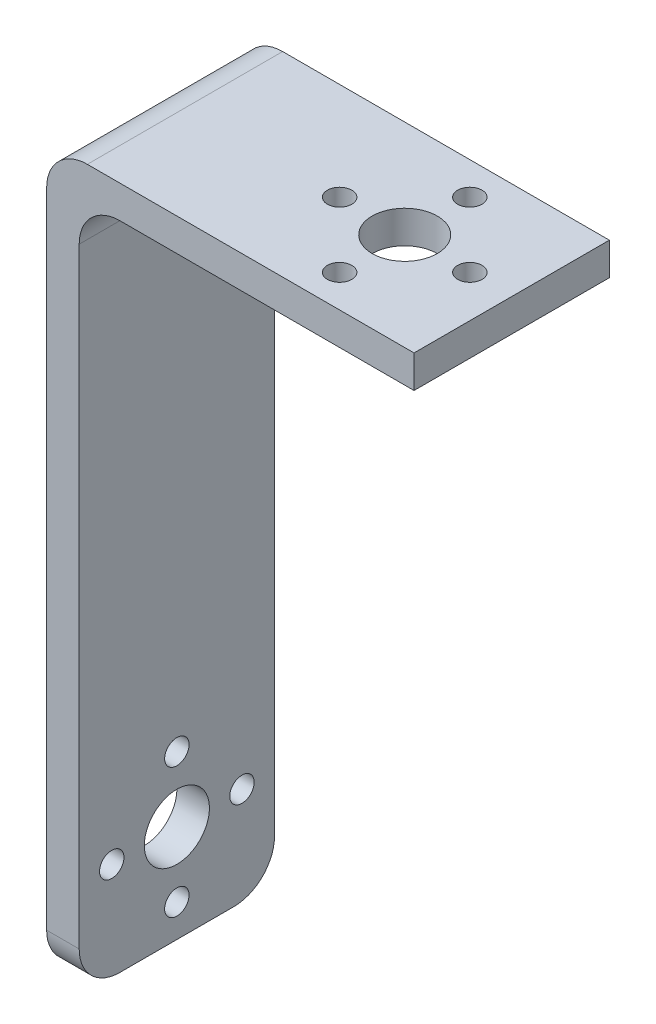
ISO-10303-21;
HEADER;
FILE_DESCRIPTION(('STEP AP214'),'2;1');
FILE_NAME('part.step','',(''),(''),'','','');
FILE_SCHEMA(('AUTOMOTIVE_DESIGN { 1 0 10303 214 1 1 1 1 }'));
ENDSEC;
DATA;
#1=APPLICATION_CONTEXT('core data for automotive mechanical design processes');
#2=APPLICATION_PROTOCOL_DEFINITION('international standard','automotive_design',2000,#1);
#3=PRODUCT_CONTEXT('',#1,'mechanical');
#4=PRODUCT('Part','Part','',(#3));
#5=PRODUCT_RELATED_PRODUCT_CATEGORY('part','',(#4));
#6=PRODUCT_DEFINITION_FORMATION('','',#4);
#7=PRODUCT_DEFINITION_CONTEXT('part definition',#1,'design');
#8=PRODUCT_DEFINITION('design','',#6,#7);
#9=PRODUCT_DEFINITION_SHAPE('','',#8);
#10=(LENGTH_UNIT() NAMED_UNIT(*) SI_UNIT(.MILLI.,.METRE.));
#11=(NAMED_UNIT(*) PLANE_ANGLE_UNIT() SI_UNIT($,.RADIAN.));
#12=(NAMED_UNIT(*) SI_UNIT($,.STERADIAN.) SOLID_ANGLE_UNIT());
#13=UNCERTAINTY_MEASURE_WITH_UNIT(LENGTH_MEASURE(1.E-05),#10,'distance_accuracy_value','');
#14=(GEOMETRIC_REPRESENTATION_CONTEXT(3) GLOBAL_UNCERTAINTY_ASSIGNED_CONTEXT((#13)) GLOBAL_UNIT_ASSIGNED_CONTEXT((#10,
#11,#12)) REPRESENTATION_CONTEXT('',''));
#15=CARTESIAN_POINT('',(0.,0.,0.));
#16=DIRECTION('',(0.,0.,1.));
#17=DIRECTION('',(1.,0.,0.));
#18=AXIS2_PLACEMENT_3D('',#15,#16,#17);
#19=CARTESIAN_POINT('',(0.,46.261961722488,24.));
#20=DIRECTION('',(0.,1.,0.));
#21=DIRECTION('',(0.,0.,1.));
#22=AXIS2_PLACEMENT_3D('',#19,#20,#21);
#23=PLANE('',#22);
#24=CARTESIAN_POINT('',(-7.94771214871035,46.261961722488,12.));
#25=DIRECTION('',(0.,1.,0.));
#26=DIRECTION('',(0.,0.,1.));
#27=AXIS2_PLACEMENT_3D('',#24,#25,#26);
#28=CIRCLE('',#27,4.);
#29=CARTESIAN_POINT('',(-7.94771214871035,46.261961722488,16.));
#30=VERTEX_POINT('',#29);
#31=EDGE_CURVE('E309',#30,#30,#28,.T.);
#32=ORIENTED_EDGE('',*,*,#31,.T.);
#33=EDGE_LOOP('',(#32));
#34=FACE_BOUND('',#33,.T.);
#35=CARTESIAN_POINT('',(-15.9477121487103,46.261961722488,11.9999999999999));
#36=DIRECTION('',(0.,1.,0.));
#37=DIRECTION('',(0.,0.,1.));
#38=AXIS2_PLACEMENT_3D('',#35,#36,#37);
#39=CIRCLE('',#38,1.5);
#40=CARTESIAN_POINT('',(-15.9477121487103,46.261961722488,13.4999999999999));
#41=VERTEX_POINT('',#40);
#42=EDGE_CURVE('E291',#41,#41,#39,.T.);
#43=ORIENTED_EDGE('',*,*,#42,.T.);
#44=EDGE_LOOP('',(#43));
#45=FACE_BOUND('',#44,.T.);
#46=CARTESIAN_POINT('',(-7.94771214871038,46.261961722488,20.));
#47=DIRECTION('',(0.,1.,0.));
#48=DIRECTION('',(0.,0.,1.));
#49=AXIS2_PLACEMENT_3D('',#46,#47,#48);
#50=CIRCLE('',#49,1.5);
#51=CARTESIAN_POINT('',(-7.94771214871038,46.261961722488,21.5));
#52=VERTEX_POINT('',#51);
#53=EDGE_CURVE('E297',#52,#52,#50,.T.);
#54=ORIENTED_EDGE('',*,*,#53,.T.);
#55=EDGE_LOOP('',(#54));
#56=FACE_BOUND('',#55,.T.);
#57=CARTESIAN_POINT('',(0.0522878512896549,46.261961722488,12.));
#58=DIRECTION('',(0.,1.,0.));
#59=DIRECTION('',(0.,0.,1.));
#60=AXIS2_PLACEMENT_3D('',#57,#58,#59);
#61=CIRCLE('',#60,1.5);
#62=CARTESIAN_POINT('',(0.0522878512896549,46.261961722488,13.5));
#63=VERTEX_POINT('',#62);
#64=EDGE_CURVE('E314',#63,#63,#61,.T.);
#65=ORIENTED_EDGE('',*,*,#64,.T.);
#66=EDGE_LOOP('',(#65));
#67=FACE_BOUND('',#66,.T.);
#68=CARTESIAN_POINT('',(-7.94771214871025,46.261961722488,4.));
#69=DIRECTION('',(0.,1.,0.));
#70=DIRECTION('',(0.,0.,1.));
#71=AXIS2_PLACEMENT_3D('',#68,#69,#70);
#72=CIRCLE('',#71,1.5);
#73=CARTESIAN_POINT('',(-7.94771214871025,46.261961722488,5.5));
#74=VERTEX_POINT('',#73);
#75=EDGE_CURVE('E324',#74,#74,#72,.T.);
#76=ORIENTED_EDGE('',*,*,#75,.T.);
#77=EDGE_LOOP('',(#76));
#78=FACE_BOUND('',#77,.T.);
#79=DIRECTION('',(1.,0.,0.));
#80=VECTOR('',#79,1.);
#81=CARTESIAN_POINT('',(0.,46.261961722488,24.));
#82=LINE('',#81,#80);
#83=CARTESIAN_POINT('',(-30.9477121487103,46.261961722488,24.));
#84=VERTEX_POINT('',#83);
#85=CARTESIAN_POINT('',(5.19705030250339,46.261961722488,24.));
#86=VERTEX_POINT('',#85);
#87=EDGE_CURVE('E117',#84,#86,#82,.T.);
#88=ORIENTED_EDGE('',*,*,#87,.F.);
#89=DIRECTION('',(0.,0.,-1.));
#90=VECTOR('',#89,1.);
#91=CARTESIAN_POINT('',(-30.9477121487103,46.261961722488,0.));
#92=LINE('',#91,#90);
#93=CARTESIAN_POINT('',(-30.9477121487103,46.261961722488,0.));
#94=VERTEX_POINT('',#93);
#95=EDGE_CURVE('E145',#84,#94,#92,.T.);
#96=ORIENTED_EDGE('',*,*,#95,.T.);
#97=DIRECTION('',(1.,0.,0.));
#98=VECTOR('',#97,1.);
#99=CARTESIAN_POINT('',(0.,46.261961722488,0.));
#100=LINE('',#99,#98);
#101=CARTESIAN_POINT('',(5.19705030250339,46.261961722488,0.));
#102=VERTEX_POINT('',#101);
#103=EDGE_CURVE('E142',#94,#102,#100,.T.);
#104=ORIENTED_EDGE('',*,*,#103,.T.);
#105=DIRECTION('',(0.,0.,-1.));
#106=VECTOR('',#105,1.);
#107=CARTESIAN_POINT('',(5.19705030250339,46.261961722488,24.));
#108=LINE('',#107,#106);
#109=EDGE_CURVE('E135',#86,#102,#108,.T.);
#110=ORIENTED_EDGE('',*,*,#109,.F.);
#111=EDGE_LOOP('',(#88,#96,#104,#110));
#112=FACE_BOUND('',#111,.T.);
#113=ADVANCED_FACE('F40',(#34,#45,#56,#67,#78,#112),#23,.F.);
#114=CARTESIAN_POINT('',(5.19705030250339,0.,24.));
#115=DIRECTION('',(-1.,0.,0.));
#116=DIRECTION('',(0.,0.,1.));
#117=AXIS2_PLACEMENT_3D('',#114,#115,#116);
#118=PLANE('',#117);
#119=DIRECTION('',(0.,1.,0.));
#120=VECTOR('',#119,1.);
#121=CARTESIAN_POINT('',(5.19705030250339,0.,0.));
#122=LINE('',#121,#120);
#123=CARTESIAN_POINT('',(5.19705030250339,50.2619617224881,0.));
#124=VERTEX_POINT('',#123);
#125=EDGE_CURVE('E382',#102,#124,#122,.T.);
#126=ORIENTED_EDGE('',*,*,#125,.T.);
#127=DIRECTION('',(0.,0.,-1.));
#128=VECTOR('',#127,1.);
#129=CARTESIAN_POINT('',(5.19705030250339,50.2619617224881,24.));
#130=LINE('',#129,#128);
#131=CARTESIAN_POINT('',(5.19705030250339,50.2619617224881,24.));
#132=VERTEX_POINT('',#131);
#133=EDGE_CURVE('E137',#132,#124,#130,.T.);
#134=ORIENTED_EDGE('',*,*,#133,.F.);
#135=DIRECTION('',(0.,1.,0.));
#136=VECTOR('',#135,1.);
#137=CARTESIAN_POINT('',(5.19705030250339,0.,24.));
#138=LINE('',#137,#136);
#139=EDGE_CURVE('E120',#86,#132,#138,.T.);
#140=ORIENTED_EDGE('',*,*,#139,.F.);
#141=ORIENTED_EDGE('',*,*,#109,.T.);
#142=EDGE_LOOP('',(#126,#134,#140,#141));
#143=FACE_BOUND('',#142,.T.);
#144=ADVANCED_FACE('F134',(#143),#118,.F.);
#145=CARTESIAN_POINT('',(0.,50.2619617224881,24.));
#146=DIRECTION('',(0.,1.,0.));
#147=DIRECTION('',(0.,0.,1.));
#148=AXIS2_PLACEMENT_3D('',#145,#146,#147);
#149=PLANE('',#148);
#150=CARTESIAN_POINT('',(-7.94771214871035,50.2619617224881,12.));
#151=DIRECTION('',(0.,1.,0.));
#152=DIRECTION('',(0.,0.,1.));
#153=AXIS2_PLACEMENT_3D('',#150,#151,#152);
#154=CIRCLE('',#153,4.);
#155=CARTESIAN_POINT('',(-7.94771214871035,50.2619617224881,16.));
#156=VERTEX_POINT('',#155);
#157=EDGE_CURVE('E306',#156,#156,#154,.T.);
#158=ORIENTED_EDGE('',*,*,#157,.F.);
#159=EDGE_LOOP('',(#158));
#160=FACE_BOUND('',#159,.T.);
#161=CARTESIAN_POINT('',(-15.9477121487103,50.2619617224881,11.9999999999999));
#162=DIRECTION('',(0.,1.,0.));
#163=DIRECTION('',(0.,0.,1.));
#164=AXIS2_PLACEMENT_3D('',#161,#162,#163);
#165=CIRCLE('',#164,1.5);
#166=CARTESIAN_POINT('',(-15.9477121487103,50.2619617224881,13.4999999999999));
#167=VERTEX_POINT('',#166);
#168=EDGE_CURVE('E294',#167,#167,#165,.T.);
#169=ORIENTED_EDGE('',*,*,#168,.F.);
#170=EDGE_LOOP('',(#169));
#171=FACE_BOUND('',#170,.T.);
#172=CARTESIAN_POINT('',(-7.94771214871038,50.2619617224881,20.));
#173=DIRECTION('',(0.,1.,0.));
#174=DIRECTION('',(0.,0.,1.));
#175=AXIS2_PLACEMENT_3D('',#172,#173,#174);
#176=CIRCLE('',#175,1.5);
#177=CARTESIAN_POINT('',(-7.94771214871038,50.2619617224881,21.5));
#178=VERTEX_POINT('',#177);
#179=EDGE_CURVE('E303',#178,#178,#176,.T.);
#180=ORIENTED_EDGE('',*,*,#179,.F.);
#181=EDGE_LOOP('',(#180));
#182=FACE_BOUND('',#181,.T.);
#183=CARTESIAN_POINT('',(0.0522878512896549,50.2619617224881,12.));
#184=DIRECTION('',(0.,1.,0.));
#185=DIRECTION('',(0.,0.,1.));
#186=AXIS2_PLACEMENT_3D('',#183,#184,#185);
#187=CIRCLE('',#186,1.5);
#188=CARTESIAN_POINT('',(0.0522878512896549,50.2619617224881,13.5));
#189=VERTEX_POINT('',#188);
#190=EDGE_CURVE('E316',#189,#189,#187,.T.);
#191=ORIENTED_EDGE('',*,*,#190,.F.);
#192=EDGE_LOOP('',(#191));
#193=FACE_BOUND('',#192,.T.);
#194=CARTESIAN_POINT('',(-7.94771214871025,50.2619617224881,4.));
#195=DIRECTION('',(0.,1.,0.));
#196=DIRECTION('',(0.,0.,1.));
#197=AXIS2_PLACEMENT_3D('',#194,#195,#196);
#198=CIRCLE('',#197,1.5);
#199=CARTESIAN_POINT('',(-7.94771214871025,50.2619617224881,5.5));
#200=VERTEX_POINT('',#199);
#201=EDGE_CURVE('E320',#200,#200,#198,.T.);
#202=ORIENTED_EDGE('',*,*,#201,.F.);
#203=EDGE_LOOP('',(#202));
#204=FACE_BOUND('',#203,.T.);
#205=DIRECTION('',(1.,0.,0.));
#206=VECTOR('',#205,1.);
#207=CARTESIAN_POINT('',(0.,50.2619617224881,0.));
#208=LINE('',#207,#206);
#209=CARTESIAN_POINT('',(-34.9477121487104,50.2619617224881,0.));
#210=VERTEX_POINT('',#209);
#211=EDGE_CURVE('E384',#210,#124,#208,.T.);
#212=ORIENTED_EDGE('',*,*,#211,.F.);
#213=DIRECTION('',(0.,0.,-1.));
#214=VECTOR('',#213,1.);
#215=CARTESIAN_POINT('',(-34.9477121487104,50.2619617224881,24.));
#216=LINE('',#215,#214);
#217=CARTESIAN_POINT('',(-34.9477121487104,50.2619617224881,24.));
#218=VERTEX_POINT('',#217);
#219=EDGE_CURVE('E56',#210,#218,#216,.F.);
#220=ORIENTED_EDGE('',*,*,#219,.T.);
#221=DIRECTION('',(1.,0.,0.));
#222=VECTOR('',#221,1.);
#223=CARTESIAN_POINT('',(0.,50.2619617224881,24.));
#224=LINE('',#223,#222);
#225=EDGE_CURVE('E139',#218,#132,#224,.T.);
#226=ORIENTED_EDGE('',*,*,#225,.T.);
#227=ORIENTED_EDGE('',*,*,#133,.T.);
#228=EDGE_LOOP('',(#212,#220,#226,#227));
#229=FACE_BOUND('',#228,.T.);
#230=ADVANCED_FACE('F229',(#160,#171,#182,#193,#204,#229),#149,.T.);
#231=CARTESIAN_POINT('',(-39.9477121487103,0.,24.));
#232=DIRECTION('',(-1.,0.,0.));
#233=DIRECTION('',(0.,0.,1.));
#234=AXIS2_PLACEMENT_3D('',#231,#232,#233);
#235=PLANE('',#234);
#236=CARTESIAN_POINT('',(-39.9477121487103,-26.7380382775119,4.));
#237=DIRECTION('',(-1.,0.,0.));
#238=DIRECTION('',(0.,0.,1.));
#239=AXIS2_PLACEMENT_3D('',#236,#237,#238);
#240=CIRCLE('',#239,1.5);
#241=CARTESIAN_POINT('',(-39.9477121487103,-26.7380382775119,5.5));
#242=VERTEX_POINT('',#241);
#243=EDGE_CURVE('E332',#242,#242,#240,.T.);
#244=ORIENTED_EDGE('',*,*,#243,.F.);
#245=EDGE_LOOP('',(#244));
#246=FACE_BOUND('',#245,.T.);
#247=CARTESIAN_POINT('',(-39.9477121487103,-34.738038277512,12.));
#248=DIRECTION('',(-1.,0.,0.));
#249=DIRECTION('',(0.,0.,1.));
#250=AXIS2_PLACEMENT_3D('',#247,#248,#249);
#251=CIRCLE('',#250,1.5);
#252=CARTESIAN_POINT('',(-39.9477121487103,-34.738038277512,13.5));
#253=VERTEX_POINT('',#252);
#254=EDGE_CURVE('E340',#253,#253,#251,.T.);
#255=ORIENTED_EDGE('',*,*,#254,.F.);
#256=EDGE_LOOP('',(#255));
#257=FACE_BOUND('',#256,.T.);
#258=CARTESIAN_POINT('',(-39.9477121487103,-26.738038277512,12.));
#259=DIRECTION('',(-1.,0.,0.));
#260=DIRECTION('',(0.,0.,1.));
#261=AXIS2_PLACEMENT_3D('',#258,#259,#260);
#262=CIRCLE('',#261,4.);
#263=CARTESIAN_POINT('',(-39.9477121487103,-26.738038277512,16.));
#264=VERTEX_POINT('',#263);
#265=EDGE_CURVE('E348',#264,#264,#262,.T.);
#266=ORIENTED_EDGE('',*,*,#265,.F.);
#267=EDGE_LOOP('',(#266));
#268=FACE_BOUND('',#267,.T.);
#269=CARTESIAN_POINT('',(-39.9477121487103,-26.738038277512,20.));
#270=DIRECTION('',(-1.,0.,0.));
#271=DIRECTION('',(0.,0.,1.));
#272=AXIS2_PLACEMENT_3D('',#269,#270,#271);
#273=CIRCLE('',#272,1.5);
#274=CARTESIAN_POINT('',(-39.9477121487103,-26.738038277512,21.5));
#275=VERTEX_POINT('',#274);
#276=EDGE_CURVE('E355',#275,#275,#273,.T.);
#277=ORIENTED_EDGE('',*,*,#276,.F.);
#278=EDGE_LOOP('',(#277));
#279=FACE_BOUND('',#278,.T.);
#280=CARTESIAN_POINT('',(-39.9477121487103,-18.738038277512,12.0000000000001));
#281=DIRECTION('',(-1.,0.,0.));
#282=DIRECTION('',(0.,0.,1.));
#283=AXIS2_PLACEMENT_3D('',#280,#281,#282);
#284=CIRCLE('',#283,1.5);
#285=CARTESIAN_POINT('',(-39.9477121487103,-18.738038277512,13.5000000000001));
#286=VERTEX_POINT('',#285);
#287=EDGE_CURVE('E359',#286,#286,#284,.T.);
#288=ORIENTED_EDGE('',*,*,#287,.F.);
#289=EDGE_LOOP('',(#288));
#290=FACE_BOUND('',#289,.T.);
#291=DIRECTION('',(0.,1.,0.));
#292=VECTOR('',#291,1.);
#293=CARTESIAN_POINT('',(-39.9477121487103,0.,24.));
#294=LINE('',#293,#292);
#295=CARTESIAN_POINT('',(-39.9477121487103,-33.738038277512,24.));
#296=VERTEX_POINT('',#295);
#297=CARTESIAN_POINT('',(-39.9477121487103,45.2619617224881,24.));
#298=VERTEX_POINT('',#297);
#299=EDGE_CURVE('E372',#296,#298,#294,.T.);
#300=ORIENTED_EDGE('',*,*,#299,.T.);
#301=DIRECTION('',(0.,0.,-1.));
#302=VECTOR('',#301,1.);
#303=CARTESIAN_POINT('',(-39.9477121487103,45.2619617224881,24.));
#304=LINE('',#303,#302);
#305=CARTESIAN_POINT('',(-39.9477121487103,45.2619617224881,0.));
#306=VERTEX_POINT('',#305);
#307=EDGE_CURVE('E170',#298,#306,#304,.T.);
#308=ORIENTED_EDGE('',*,*,#307,.T.);
#309=DIRECTION('',(0.,1.,0.));
#310=VECTOR('',#309,1.);
#311=CARTESIAN_POINT('',(-39.9477121487103,0.,0.));
#312=LINE('',#311,#310);
#313=CARTESIAN_POINT('',(-39.9477121487103,-33.738038277512,0.));
#314=VERTEX_POINT('',#313);
#315=EDGE_CURVE('E206',#314,#306,#312,.T.);
#316=ORIENTED_EDGE('',*,*,#315,.F.);
#317=CARTESIAN_POINT('',(-39.9477121487103,-33.738038277512,5.));
#318=DIRECTION('',(-1.,0.,0.));
#319=DIRECTION('',(0.,0.,1.));
#320=AXIS2_PLACEMENT_3D('',#317,#318,#319);
#321=CIRCLE('',#320,5.);
#322=CARTESIAN_POINT('',(-39.9477121487103,-38.738038277512,5.));
#323=VERTEX_POINT('',#322);
#324=EDGE_CURVE('E167',#314,#323,#321,.T.);
#325=ORIENTED_EDGE('',*,*,#324,.T.);
#326=DIRECTION('',(0.,0.,-1.));
#327=VECTOR('',#326,1.);
#328=CARTESIAN_POINT('',(-39.9477121487103,-38.738038277512,24.));
#329=LINE('',#328,#327);
#330=CARTESIAN_POINT('',(-39.9477121487103,-38.738038277512,19.));
#331=VERTEX_POINT('',#330);
#332=EDGE_CURVE('E152',#331,#323,#329,.T.);
#333=ORIENTED_EDGE('',*,*,#332,.F.);
#334=CARTESIAN_POINT('',(-39.9477121487103,-33.738038277512,19.));
#335=DIRECTION('',(-1.,0.,0.));
#336=DIRECTION('',(0.,0.,1.));
#337=AXIS2_PLACEMENT_3D('',#334,#335,#336);
#338=CIRCLE('',#337,5.);
#339=EDGE_CURVE('E164',#331,#296,#338,.T.);
#340=ORIENTED_EDGE('',*,*,#339,.T.);
#341=EDGE_LOOP('',(#300,#308,#316,#325,#333,#340));
#342=FACE_BOUND('',#341,.T.);
#343=ADVANCED_FACE('F236',(#246,#257,#268,#279,#290,#342),#235,.T.);
#344=CARTESIAN_POINT('',(0.,-38.738038277512,24.));
#345=DIRECTION('',(0.,1.,0.));
#346=DIRECTION('',(0.,0.,1.));
#347=AXIS2_PLACEMENT_3D('',#344,#345,#346);
#348=PLANE('',#347);
#349=ORIENTED_EDGE('',*,*,#332,.T.);
#350=DIRECTION('',(1.,0.,0.));
#351=VECTOR('',#350,1.);
#352=CARTESIAN_POINT('',(0.,-38.738038277512,5.));
#353=LINE('',#352,#351);
#354=CARTESIAN_POINT('',(-35.9477121487103,-38.738038277512,5.));
#355=VERTEX_POINT('',#354);
#356=EDGE_CURVE('E191',#323,#355,#353,.T.);
#357=ORIENTED_EDGE('',*,*,#356,.T.);
#358=DIRECTION('',(0.,0.,-1.));
#359=VECTOR('',#358,1.);
#360=CARTESIAN_POINT('',(-35.9477121487103,-38.738038277512,24.));
#361=LINE('',#360,#359);
#362=CARTESIAN_POINT('',(-35.9477121487103,-38.738038277512,19.));
#363=VERTEX_POINT('',#362);
#364=EDGE_CURVE('E379',#363,#355,#361,.T.);
#365=ORIENTED_EDGE('',*,*,#364,.F.);
#366=DIRECTION('',(1.,0.,0.));
#367=VECTOR('',#366,1.);
#368=CARTESIAN_POINT('',(-39.9477121487103,-38.738038277512,19.));
#369=LINE('',#368,#367);
#370=EDGE_CURVE('E188',#363,#331,#369,.F.);
#371=ORIENTED_EDGE('',*,*,#370,.T.);
#372=EDGE_LOOP('',(#349,#357,#365,#371));
#373=FACE_BOUND('',#372,.T.);
#374=ADVANCED_FACE('F240',(#373),#348,.F.);
#375=CARTESIAN_POINT('',(-35.9477121487103,0.,24.));
#376=DIRECTION('',(-1.,0.,0.));
#377=DIRECTION('',(0.,0.,1.));
#378=AXIS2_PLACEMENT_3D('',#375,#376,#377);
#379=PLANE('',#378);
#380=CARTESIAN_POINT('',(-35.9477121487103,-26.7380382775119,4.));
#381=DIRECTION('',(-1.,0.,0.));
#382=DIRECTION('',(0.,0.,1.));
#383=AXIS2_PLACEMENT_3D('',#380,#381,#382);
#384=CIRCLE('',#383,1.5);
#385=CARTESIAN_POINT('',(-35.9477121487103,-26.7380382775119,5.5));
#386=VERTEX_POINT('',#385);
#387=EDGE_CURVE('E328',#386,#386,#384,.T.);
#388=ORIENTED_EDGE('',*,*,#387,.T.);
#389=EDGE_LOOP('',(#388));
#390=FACE_BOUND('',#389,.T.);
#391=CARTESIAN_POINT('',(-35.9477121487103,-34.738038277512,12.));
#392=DIRECTION('',(-1.,0.,0.));
#393=DIRECTION('',(0.,0.,1.));
#394=AXIS2_PLACEMENT_3D('',#391,#392,#393);
#395=CIRCLE('',#394,1.5);
#396=CARTESIAN_POINT('',(-35.9477121487103,-34.738038277512,13.5));
#397=VERTEX_POINT('',#396);
#398=EDGE_CURVE('E336',#397,#397,#395,.T.);
#399=ORIENTED_EDGE('',*,*,#398,.T.);
#400=EDGE_LOOP('',(#399));
#401=FACE_BOUND('',#400,.T.);
#402=CARTESIAN_POINT('',(-35.9477121487103,-26.738038277512,12.));
#403=DIRECTION('',(-1.,0.,0.));
#404=DIRECTION('',(0.,0.,1.));
#405=AXIS2_PLACEMENT_3D('',#402,#403,#404);
#406=CIRCLE('',#405,4.);
#407=CARTESIAN_POINT('',(-35.9477121487103,-26.738038277512,16.));
#408=VERTEX_POINT('',#407);
#409=EDGE_CURVE('E344',#408,#408,#406,.T.);
#410=ORIENTED_EDGE('',*,*,#409,.T.);
#411=EDGE_LOOP('',(#410));
#412=FACE_BOUND('',#411,.T.);
#413=CARTESIAN_POINT('',(-35.9477121487103,-26.738038277512,20.));
#414=DIRECTION('',(-1.,0.,0.));
#415=DIRECTION('',(0.,0.,1.));
#416=AXIS2_PLACEMENT_3D('',#413,#414,#415);
#417=CIRCLE('',#416,1.5);
#418=CARTESIAN_POINT('',(-35.9477121487103,-26.738038277512,21.5));
#419=VERTEX_POINT('',#418);
#420=EDGE_CURVE('E351',#419,#419,#417,.T.);
#421=ORIENTED_EDGE('',*,*,#420,.T.);
#422=EDGE_LOOP('',(#421));
#423=FACE_BOUND('',#422,.T.);
#424=CARTESIAN_POINT('',(-35.9477121487103,-18.738038277512,12.0000000000001));
#425=DIRECTION('',(-1.,0.,0.));
#426=DIRECTION('',(0.,0.,1.));
#427=AXIS2_PLACEMENT_3D('',#424,#425,#426);
#428=CIRCLE('',#427,1.5);
#429=CARTESIAN_POINT('',(-35.9477121487103,-18.738038277512,13.5000000000001));
#430=VERTEX_POINT('',#429);
#431=EDGE_CURVE('E363',#430,#430,#428,.T.);
#432=ORIENTED_EDGE('',*,*,#431,.T.);
#433=EDGE_LOOP('',(#432));
#434=FACE_BOUND('',#433,.T.);
#435=DIRECTION('',(0.,1.,0.));
#436=VECTOR('',#435,1.);
#437=CARTESIAN_POINT('',(-35.9477121487103,0.,0.));
#438=LINE('',#437,#436);
#439=CARTESIAN_POINT('',(-35.9477121487103,-33.738038277512,0.));
#440=VERTEX_POINT('',#439);
#441=CARTESIAN_POINT('',(-35.9477121487103,41.261961722488,0.));
#442=VERTEX_POINT('',#441);
#443=EDGE_CURVE('E129',#440,#442,#438,.T.);
#444=ORIENTED_EDGE('',*,*,#443,.T.);
#445=DIRECTION('',(0.,0.,-1.));
#446=VECTOR('',#445,1.);
#447=CARTESIAN_POINT('',(-35.9477121487103,41.261961722488,24.));
#448=LINE('',#447,#446);
#449=CARTESIAN_POINT('',(-35.9477121487103,41.261961722488,24.));
#450=VERTEX_POINT('',#449);
#451=EDGE_CURVE('E161',#442,#450,#448,.F.);
#452=ORIENTED_EDGE('',*,*,#451,.T.);
#453=DIRECTION('',(0.,1.,0.));
#454=VECTOR('',#453,1.);
#455=CARTESIAN_POINT('',(-35.9477121487103,0.,24.));
#456=LINE('',#455,#454);
#457=CARTESIAN_POINT('',(-35.9477121487103,-33.738038277512,24.));
#458=VERTEX_POINT('',#457);
#459=EDGE_CURVE('E376',#458,#450,#456,.T.);
#460=ORIENTED_EDGE('',*,*,#459,.F.);
#461=CARTESIAN_POINT('',(-35.9477121487103,-33.738038277512,19.));
#462=DIRECTION('',(-1.,0.,0.));
#463=DIRECTION('',(0.,0.,1.));
#464=AXIS2_PLACEMENT_3D('',#461,#462,#463);
#465=CIRCLE('',#464,5.);
#466=EDGE_CURVE('E149',#458,#363,#465,.F.);
#467=ORIENTED_EDGE('',*,*,#466,.T.);
#468=ORIENTED_EDGE('',*,*,#364,.T.);
#469=CARTESIAN_POINT('',(-35.9477121487103,-33.738038277512,5.));
#470=DIRECTION('',(-1.,0.,0.));
#471=DIRECTION('',(0.,0.,1.));
#472=AXIS2_PLACEMENT_3D('',#469,#470,#471);
#473=CIRCLE('',#472,5.);
#474=EDGE_CURVE('E158',#355,#440,#473,.F.);
#475=ORIENTED_EDGE('',*,*,#474,.T.);
#476=EDGE_LOOP('',(#444,#452,#460,#467,#468,#475));
#477=FACE_BOUND('',#476,.T.);
#478=ADVANCED_FACE('F202',(#390,#401,#412,#423,#434,#477),#379,.F.);
#479=CARTESIAN_POINT('',(0.,0.,24.));
#480=DIRECTION('',(0.,0.,1.));
#481=DIRECTION('',(1.,0.,0.));
#482=AXIS2_PLACEMENT_3D('',#479,#480,#481);
#483=PLANE('',#482);
#484=ORIENTED_EDGE('',*,*,#225,.F.);
#485=CARTESIAN_POINT('',(-34.9477121487104,45.2619617224881,24.));
#486=DIRECTION('',(0.,0.,1.));
#487=DIRECTION('',(1.,0.,0.));
#488=AXIS2_PLACEMENT_3D('',#485,#486,#487);
#489=CIRCLE('',#488,5.);
#490=EDGE_CURVE('E185',#218,#298,#489,.T.);
#491=ORIENTED_EDGE('',*,*,#490,.T.);
#492=ORIENTED_EDGE('',*,*,#299,.F.);
#493=DIRECTION('',(1.,0.,0.));
#494=VECTOR('',#493,1.);
#495=CARTESIAN_POINT('',(-35.9477121487103,-33.738038277512,24.));
#496=LINE('',#495,#494);
#497=EDGE_CURVE('E181',#296,#458,#496,.T.);
#498=ORIENTED_EDGE('',*,*,#497,.T.);
#499=ORIENTED_EDGE('',*,*,#459,.T.);
#500=CARTESIAN_POINT('',(-30.9477121487103,41.261961722488,24.));
#501=DIRECTION('',(0.,0.,1.));
#502=DIRECTION('',(1.,0.,0.));
#503=AXIS2_PLACEMENT_3D('',#500,#501,#502);
#504=CIRCLE('',#503,5.);
#505=EDGE_CURVE('E11',#450,#84,#504,.F.);
#506=ORIENTED_EDGE('',*,*,#505,.T.);
#507=ORIENTED_EDGE('',*,*,#87,.T.);
#508=ORIENTED_EDGE('',*,*,#139,.T.);
#509=EDGE_LOOP('',(#484,#491,#492,#498,#499,#506,#507,#508));
#510=FACE_BOUND('',#509,.T.);
#511=ADVANCED_FACE('F119',(#510),#483,.T.);
#512=CARTESIAN_POINT('',(0.,0.,0.));
#513=DIRECTION('',(0.,0.,1.));
#514=DIRECTION('',(1.,0.,0.));
#515=AXIS2_PLACEMENT_3D('',#512,#513,#514);
#516=PLANE('',#515);
#517=ORIENTED_EDGE('',*,*,#315,.T.);
#518=CARTESIAN_POINT('',(-34.9477121487104,45.2619617224881,0.));
#519=DIRECTION('',(0.,0.,1.));
#520=DIRECTION('',(1.,0.,0.));
#521=AXIS2_PLACEMENT_3D('',#518,#519,#520);
#522=CIRCLE('',#521,5.);
#523=EDGE_CURVE('E64',#306,#210,#522,.F.);
#524=ORIENTED_EDGE('',*,*,#523,.T.);
#525=ORIENTED_EDGE('',*,*,#211,.T.);
#526=ORIENTED_EDGE('',*,*,#125,.F.);
#527=ORIENTED_EDGE('',*,*,#103,.F.);
#528=CARTESIAN_POINT('',(-30.9477121487103,41.261961722488,0.));
#529=DIRECTION('',(0.,0.,1.));
#530=DIRECTION('',(1.,0.,0.));
#531=AXIS2_PLACEMENT_3D('',#528,#529,#530);
#532=CIRCLE('',#531,5.);
#533=EDGE_CURVE('E49',#94,#442,#532,.T.);
#534=ORIENTED_EDGE('',*,*,#533,.T.);
#535=ORIENTED_EDGE('',*,*,#443,.F.);
#536=DIRECTION('',(1.,0.,0.));
#537=VECTOR('',#536,1.);
#538=CARTESIAN_POINT('',(0.,-33.738038277512,0.));
#539=LINE('',#538,#537);
#540=EDGE_CURVE('E174',#440,#314,#539,.F.);
#541=ORIENTED_EDGE('',*,*,#540,.T.);
#542=EDGE_LOOP('',(#517,#524,#525,#526,#527,#534,#535,#541));
#543=FACE_BOUND('',#542,.T.);
#544=ADVANCED_FACE('F197',(#543),#516,.F.);
#545=CARTESIAN_POINT('',(-35.9477121487103,-18.738038277512,12.0000000000001));
#546=DIRECTION('',(-1.,0.,0.));
#547=DIRECTION('',(0.,0.,1.));
#548=AXIS2_PLACEMENT_3D('',#545,#546,#547);
#549=CYLINDRICAL_SURFACE('',#548,1.5);
#550=ORIENTED_EDGE('',*,*,#431,.F.);
#551=EDGE_LOOP('',(#550));
#552=FACE_BOUND('',#551,.T.);
#553=ORIENTED_EDGE('',*,*,#287,.T.);
#554=EDGE_LOOP('',(#553));
#555=FACE_BOUND('',#554,.T.);
#556=ADVANCED_FACE('F250',(#552,#555),#549,.F.);
#557=CARTESIAN_POINT('',(-35.9477121487103,-26.738038277512,20.));
#558=DIRECTION('',(-1.,0.,0.));
#559=DIRECTION('',(0.,0.,1.));
#560=AXIS2_PLACEMENT_3D('',#557,#558,#559);
#561=CYLINDRICAL_SURFACE('',#560,1.5);
#562=ORIENTED_EDGE('',*,*,#420,.F.);
#563=EDGE_LOOP('',(#562));
#564=FACE_BOUND('',#563,.T.);
#565=ORIENTED_EDGE('',*,*,#276,.T.);
#566=EDGE_LOOP('',(#565));
#567=FACE_BOUND('',#566,.T.);
#568=ADVANCED_FACE('F255',(#564,#567),#561,.F.);
#569=CARTESIAN_POINT('',(-35.9477121487103,-26.738038277512,12.));
#570=DIRECTION('',(-1.,0.,0.));
#571=DIRECTION('',(0.,0.,1.));
#572=AXIS2_PLACEMENT_3D('',#569,#570,#571);
#573=CYLINDRICAL_SURFACE('',#572,4.);
#574=ORIENTED_EDGE('',*,*,#409,.F.);
#575=EDGE_LOOP('',(#574));
#576=FACE_BOUND('',#575,.T.);
#577=ORIENTED_EDGE('',*,*,#265,.T.);
#578=EDGE_LOOP('',(#577));
#579=FACE_BOUND('',#578,.T.);
#580=ADVANCED_FACE('F259',(#576,#579),#573,.F.);
#581=CARTESIAN_POINT('',(-35.9477121487103,-34.738038277512,12.));
#582=DIRECTION('',(-1.,0.,0.));
#583=DIRECTION('',(0.,0.,1.));
#584=AXIS2_PLACEMENT_3D('',#581,#582,#583);
#585=CYLINDRICAL_SURFACE('',#584,1.5);
#586=ORIENTED_EDGE('',*,*,#398,.F.);
#587=EDGE_LOOP('',(#586));
#588=FACE_BOUND('',#587,.T.);
#589=ORIENTED_EDGE('',*,*,#254,.T.);
#590=EDGE_LOOP('',(#589));
#591=FACE_BOUND('',#590,.T.);
#592=ADVANCED_FACE('F263',(#588,#591),#585,.F.);
#593=CARTESIAN_POINT('',(-35.9477121487103,-26.7380382775119,4.));
#594=DIRECTION('',(-1.,0.,0.));
#595=DIRECTION('',(0.,0.,1.));
#596=AXIS2_PLACEMENT_3D('',#593,#594,#595);
#597=CYLINDRICAL_SURFACE('',#596,1.5);
#598=ORIENTED_EDGE('',*,*,#387,.F.);
#599=EDGE_LOOP('',(#598));
#600=FACE_BOUND('',#599,.T.);
#601=ORIENTED_EDGE('',*,*,#243,.T.);
#602=EDGE_LOOP('',(#601));
#603=FACE_BOUND('',#602,.T.);
#604=ADVANCED_FACE('F267',(#600,#603),#597,.F.);
#605=CARTESIAN_POINT('',(-7.94771214871025,46.261961722488,4.));
#606=DIRECTION('',(0.,1.,0.));
#607=DIRECTION('',(0.,0.,1.));
#608=AXIS2_PLACEMENT_3D('',#605,#606,#607);
#609=CYLINDRICAL_SURFACE('',#608,1.5);
#610=ORIENTED_EDGE('',*,*,#75,.F.);
#611=EDGE_LOOP('',(#610));
#612=FACE_BOUND('',#611,.T.);
#613=ORIENTED_EDGE('',*,*,#201,.T.);
#614=EDGE_LOOP('',(#613));
#615=FACE_BOUND('',#614,.T.);
#616=ADVANCED_FACE('F271',(#612,#615),#609,.F.);
#617=CARTESIAN_POINT('',(0.0522878512896549,46.261961722488,12.));
#618=DIRECTION('',(0.,1.,0.));
#619=DIRECTION('',(0.,0.,1.));
#620=AXIS2_PLACEMENT_3D('',#617,#618,#619);
#621=CYLINDRICAL_SURFACE('',#620,1.5);
#622=ORIENTED_EDGE('',*,*,#64,.F.);
#623=EDGE_LOOP('',(#622));
#624=FACE_BOUND('',#623,.T.);
#625=ORIENTED_EDGE('',*,*,#190,.T.);
#626=EDGE_LOOP('',(#625));
#627=FACE_BOUND('',#626,.T.);
#628=ADVANCED_FACE('F275',(#624,#627),#621,.F.);
#629=CARTESIAN_POINT('',(-7.94771214871038,46.261961722488,20.));
#630=DIRECTION('',(0.,1.,0.));
#631=DIRECTION('',(0.,0.,1.));
#632=AXIS2_PLACEMENT_3D('',#629,#630,#631);
#633=CYLINDRICAL_SURFACE('',#632,1.5);
#634=ORIENTED_EDGE('',*,*,#53,.F.);
#635=EDGE_LOOP('',(#634));
#636=FACE_BOUND('',#635,.T.);
#637=ORIENTED_EDGE('',*,*,#179,.T.);
#638=EDGE_LOOP('',(#637));
#639=FACE_BOUND('',#638,.T.);
#640=ADVANCED_FACE('F279',(#636,#639),#633,.F.);
#641=CARTESIAN_POINT('',(-15.9477121487103,46.261961722488,11.9999999999999));
#642=DIRECTION('',(0.,1.,0.));
#643=DIRECTION('',(0.,0.,1.));
#644=AXIS2_PLACEMENT_3D('',#641,#642,#643);
#645=CYLINDRICAL_SURFACE('',#644,1.5);
#646=ORIENTED_EDGE('',*,*,#42,.F.);
#647=EDGE_LOOP('',(#646));
#648=FACE_BOUND('',#647,.T.);
#649=ORIENTED_EDGE('',*,*,#168,.T.);
#650=EDGE_LOOP('',(#649));
#651=FACE_BOUND('',#650,.T.);
#652=ADVANCED_FACE('F220',(#648,#651),#645,.F.);
#653=CARTESIAN_POINT('',(-7.94771214871035,46.261961722488,12.));
#654=DIRECTION('',(0.,1.,0.));
#655=DIRECTION('',(0.,0.,1.));
#656=AXIS2_PLACEMENT_3D('',#653,#654,#655);
#657=CYLINDRICAL_SURFACE('',#656,4.);
#658=ORIENTED_EDGE('',*,*,#31,.F.);
#659=EDGE_LOOP('',(#658));
#660=FACE_BOUND('',#659,.T.);
#661=ORIENTED_EDGE('',*,*,#157,.T.);
#662=EDGE_LOOP('',(#661));
#663=FACE_BOUND('',#662,.T.);
#664=ADVANCED_FACE('F211',(#660,#663),#657,.F.);
#665=CARTESIAN_POINT('',(-30.9477121487103,41.261961722488,24.));
#666=DIRECTION('',(0.,0.,1.));
#667=DIRECTION('',(1.,0.,0.));
#668=AXIS2_PLACEMENT_3D('',#665,#666,#667);
#669=CYLINDRICAL_SURFACE('',#668,5.);
#670=ORIENTED_EDGE('',*,*,#505,.F.);
#671=ORIENTED_EDGE('',*,*,#451,.F.);
#672=ORIENTED_EDGE('',*,*,#533,.F.);
#673=ORIENTED_EDGE('',*,*,#95,.F.);
#674=EDGE_LOOP('',(#670,#671,#672,#673));
#675=FACE_BOUND('',#674,.T.);
#676=ADVANCED_FACE('F208',(#675),#669,.F.);
#677=CARTESIAN_POINT('',(-34.9477121487104,45.2619617224881,24.));
#678=DIRECTION('',(0.,0.,-1.));
#679=DIRECTION('',(-1.,0.,0.));
#680=AXIS2_PLACEMENT_3D('',#677,#678,#679);
#681=CYLINDRICAL_SURFACE('',#680,5.);
#682=ORIENTED_EDGE('',*,*,#490,.F.);
#683=ORIENTED_EDGE('',*,*,#219,.F.);
#684=ORIENTED_EDGE('',*,*,#523,.F.);
#685=ORIENTED_EDGE('',*,*,#307,.F.);
#686=EDGE_LOOP('',(#682,#683,#684,#685));
#687=FACE_BOUND('',#686,.T.);
#688=ADVANCED_FACE('F210',(#687),#681,.T.);
#689=CARTESIAN_POINT('',(0.,-33.738038277512,5.));
#690=DIRECTION('',(1.,0.,0.));
#691=DIRECTION('',(0.,0.,-1.));
#692=AXIS2_PLACEMENT_3D('',#689,#690,#691);
#693=CYLINDRICAL_SURFACE('',#692,5.);
#694=ORIENTED_EDGE('',*,*,#324,.F.);
#695=ORIENTED_EDGE('',*,*,#540,.F.);
#696=ORIENTED_EDGE('',*,*,#474,.F.);
#697=ORIENTED_EDGE('',*,*,#356,.F.);
#698=EDGE_LOOP('',(#694,#695,#696,#697));
#699=FACE_BOUND('',#698,.T.);
#700=ADVANCED_FACE('F217',(#699),#693,.T.);
#701=CARTESIAN_POINT('',(0.,-33.738038277512,19.));
#702=DIRECTION('',(-1.,0.,0.));
#703=DIRECTION('',(0.,0.,1.));
#704=AXIS2_PLACEMENT_3D('',#701,#702,#703);
#705=CYLINDRICAL_SURFACE('',#704,5.);
#706=ORIENTED_EDGE('',*,*,#339,.F.);
#707=ORIENTED_EDGE('',*,*,#370,.F.);
#708=ORIENTED_EDGE('',*,*,#466,.F.);
#709=ORIENTED_EDGE('',*,*,#497,.F.);
#710=EDGE_LOOP('',(#706,#707,#708,#709));
#711=FACE_BOUND('',#710,.T.);
#712=ADVANCED_FACE('F42',(#711),#705,.T.);
#713=CLOSED_SHELL('',(#113,#144,#230,#343,#374,#478,#511,#544,#556,#568,#580,#592,#604,#616,
#628,#640,#652,#664,#676,#688,#700,#712));
#714=MANIFOLD_SOLID_BREP('B2',#713);
#715=ADVANCED_BREP_SHAPE_REPRESENTATION('',(#18,#714),#14);
#716=SHAPE_DEFINITION_REPRESENTATION(#9,#715);
ENDSEC;
END-ISO-10303-21;
